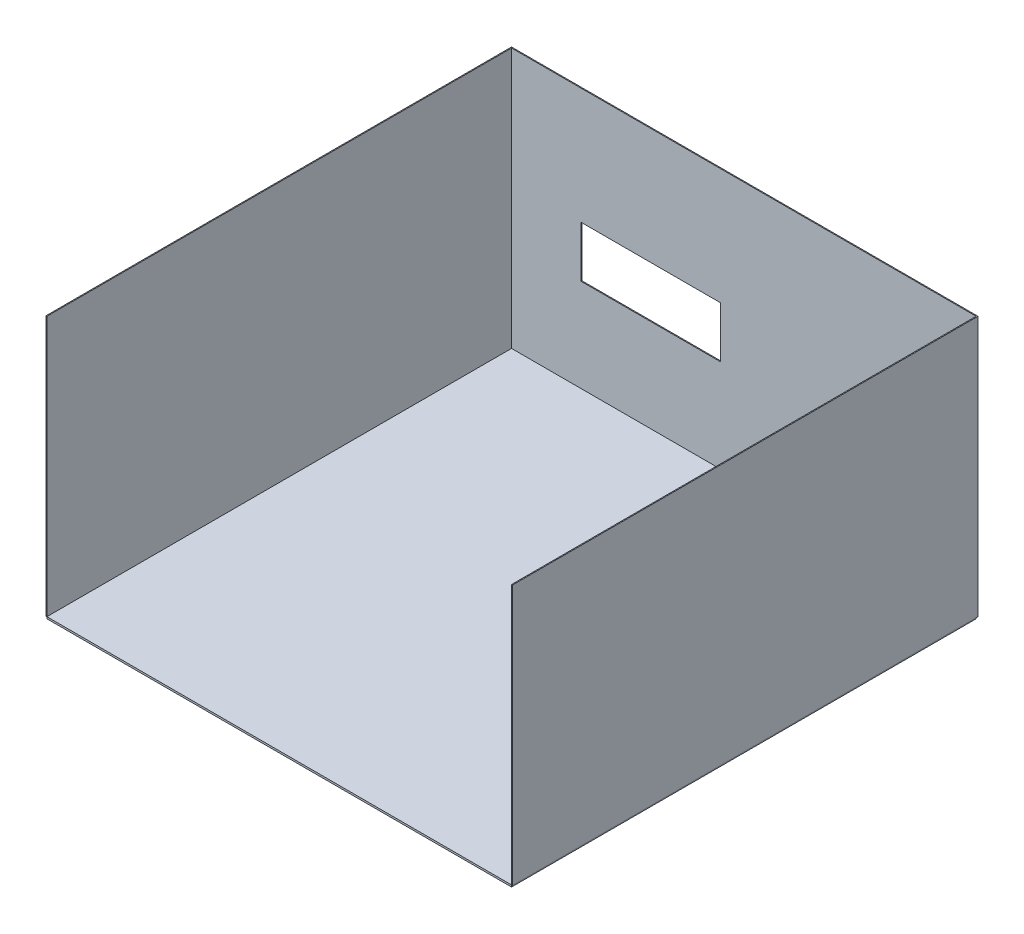
ISO-10303-21;
HEADER;
FILE_DESCRIPTION(('STEP AP214'),'2;1');
FILE_NAME('part.step','',(''),(''),'','','');
FILE_SCHEMA(('AUTOMOTIVE_DESIGN { 1 0 10303 214 1 1 1 1 }'));
ENDSEC;
DATA;
#1=APPLICATION_CONTEXT('core data for automotive mechanical design processes');
#2=APPLICATION_PROTOCOL_DEFINITION('international standard','automotive_design',2000,#1);
#3=PRODUCT_CONTEXT('',#1,'mechanical');
#4=PRODUCT('Part','Part','',(#3));
#5=PRODUCT_RELATED_PRODUCT_CATEGORY('part','',(#4));
#6=PRODUCT_DEFINITION_FORMATION('','',#4);
#7=PRODUCT_DEFINITION_CONTEXT('part definition',#1,'design');
#8=PRODUCT_DEFINITION('design','',#6,#7);
#9=PRODUCT_DEFINITION_SHAPE('','',#8);
#10=(LENGTH_UNIT() NAMED_UNIT(*) SI_UNIT(.MILLI.,.METRE.));
#11=(NAMED_UNIT(*) PLANE_ANGLE_UNIT() SI_UNIT($,.RADIAN.));
#12=(NAMED_UNIT(*) SI_UNIT($,.STERADIAN.) SOLID_ANGLE_UNIT());
#13=UNCERTAINTY_MEASURE_WITH_UNIT(LENGTH_MEASURE(1.E-05),#10,'distance_accuracy_value','');
#14=(GEOMETRIC_REPRESENTATION_CONTEXT(3) GLOBAL_UNCERTAINTY_ASSIGNED_CONTEXT((#13)) GLOBAL_UNIT_ASSIGNED_CONTEXT((#10,
#11,#12)) REPRESENTATION_CONTEXT('',''));
#15=CARTESIAN_POINT('',(0.,0.,0.));
#16=DIRECTION('',(0.,0.,1.));
#17=DIRECTION('',(1.,0.,0.));
#18=AXIS2_PLACEMENT_3D('',#15,#16,#17);
#19=CARTESIAN_POINT('',(-33710.6161425006,2820.,-2909.64545631748));
#20=DIRECTION('',(1.,0.,0.));
#21=DIRECTION('',(0.,0.,-1.));
#22=AXIS2_PLACEMENT_3D('',#19,#20,#21);
#23=PLANE('',#22);
#24=DIRECTION('',(0.,0.,-1.));
#25=VECTOR('',#24,1.);
#26=CARTESIAN_POINT('',(-33710.6161425006,20.,-2909.64545631748));
#27=LINE('',#26,#25);
#28=CARTESIAN_POINT('',(-33710.6161425006,20.,-2919.64545631748));
#29=VERTEX_POINT('',#28);
#30=CARTESIAN_POINT('',(-33710.6161425006,20.,2090.35454368252));
#31=VERTEX_POINT('',#30);
#32=EDGE_CURVE('E168',#29,#31,#27,.F.);
#33=ORIENTED_EDGE('',*,*,#32,.T.);
#34=DIRECTION('',(0.,-1.,0.));
#35=VECTOR('',#34,1.);
#36=CARTESIAN_POINT('',(-33710.6161425006,2820.,2090.35454368252));
#37=LINE('',#36,#35);
#38=CARTESIAN_POINT('',(-33710.6161425006,2820.,2090.35454368252));
#39=VERTEX_POINT('',#38);
#40=EDGE_CURVE('E12',#39,#31,#37,.T.);
#41=ORIENTED_EDGE('',*,*,#40,.F.);
#42=DIRECTION('',(0.,0.,-1.));
#43=VECTOR('',#42,1.);
#44=CARTESIAN_POINT('',(-33710.6161425006,2820.,-2909.64545631748));
#45=LINE('',#44,#43);
#46=CARTESIAN_POINT('',(-33710.6161425006,2820.,-2919.64545631748));
#47=VERTEX_POINT('',#46);
#48=EDGE_CURVE('E172',#47,#39,#45,.F.);
#49=ORIENTED_EDGE('',*,*,#48,.F.);
#50=DIRECTION('',(0.,-1.,0.));
#51=VECTOR('',#50,1.);
#52=CARTESIAN_POINT('',(-33710.6161425006,2820.,-2919.64545631748));
#53=LINE('',#52,#51);
#54=EDGE_CURVE('E194',#47,#29,#53,.T.);
#55=ORIENTED_EDGE('',*,*,#54,.T.);
#56=EDGE_LOOP('',(#33,#41,#49,#55));
#57=FACE_BOUND('',#56,.T.);
#58=ADVANCED_FACE('F48',(#57),#23,.F.);
#59=CARTESIAN_POINT('',(-33700.6161425006,2820.,2090.35454368252));
#60=DIRECTION('',(0.,0.,1.));
#61=DIRECTION('',(1.,0.,0.));
#62=AXIS2_PLACEMENT_3D('',#59,#60,#61);
#63=PLANE('',#62);
#64=DIRECTION('',(-1.,0.,0.));
#65=VECTOR('',#64,1.);
#66=CARTESIAN_POINT('',(-33700.6161425006,20.,2090.35454368252));
#67=LINE('',#66,#65);
#68=CARTESIAN_POINT('',(-33700.6161425006,20.,2090.35454368252));
#69=VERTEX_POINT('',#68);
#70=EDGE_CURVE('E197',#69,#31,#67,.T.);
#71=ORIENTED_EDGE('',*,*,#70,.F.);
#72=DIRECTION('',(0.,-1.,0.));
#73=VECTOR('',#72,1.);
#74=CARTESIAN_POINT('',(-33700.6161425006,2820.,2090.35454368252));
#75=LINE('',#74,#73);
#76=CARTESIAN_POINT('',(-33700.6161425006,2820.,2090.35454368252));
#77=VERTEX_POINT('',#76);
#78=EDGE_CURVE('E55',#77,#69,#75,.T.);
#79=ORIENTED_EDGE('',*,*,#78,.F.);
#80=DIRECTION('',(-1.,0.,0.));
#81=VECTOR('',#80,1.);
#82=CARTESIAN_POINT('',(-33700.6161425006,2820.,2090.35454368252));
#83=LINE('',#82,#81);
#84=EDGE_CURVE('E174',#77,#39,#83,.T.);
#85=ORIENTED_EDGE('',*,*,#84,.T.);
#86=ORIENTED_EDGE('',*,*,#40,.T.);
#87=EDGE_LOOP('',(#71,#79,#85,#86));
#88=FACE_BOUND('',#87,.T.);
#89=ADVANCED_FACE('F234',(#88),#63,.T.);
#90=CARTESIAN_POINT('',(-33700.6161425006,2820.,-2909.64545631748));
#91=DIRECTION('',(1.,0.,0.));
#92=DIRECTION('',(0.,0.,-1.));
#93=AXIS2_PLACEMENT_3D('',#90,#91,#92);
#94=PLANE('',#93);
#95=DIRECTION('',(0.,0.,1.));
#96=VECTOR('',#95,1.);
#97=CARTESIAN_POINT('',(-33700.6161425006,20.,-2909.64545631748));
#98=LINE('',#97,#96);
#99=CARTESIAN_POINT('',(-33700.6161425006,20.,-2909.64545631748));
#100=VERTEX_POINT('',#99);
#101=EDGE_CURVE('E200',#100,#69,#98,.T.);
#102=ORIENTED_EDGE('',*,*,#101,.F.);
#103=DIRECTION('',(0.,-1.,0.));
#104=VECTOR('',#103,1.);
#105=CARTESIAN_POINT('',(-33700.6161425006,2820.,-2909.64545631748));
#106=LINE('',#105,#104);
#107=CARTESIAN_POINT('',(-33700.6161425006,2820.,-2909.64545631748));
#108=VERTEX_POINT('',#107);
#109=EDGE_CURVE('E226',#108,#100,#106,.T.);
#110=ORIENTED_EDGE('',*,*,#109,.F.);
#111=DIRECTION('',(0.,0.,1.));
#112=VECTOR('',#111,1.);
#113=CARTESIAN_POINT('',(-33700.6161425006,2820.,-2909.64545631748));
#114=LINE('',#113,#112);
#115=EDGE_CURVE('E178',#108,#77,#114,.T.);
#116=ORIENTED_EDGE('',*,*,#115,.T.);
#117=ORIENTED_EDGE('',*,*,#78,.T.);
#118=EDGE_LOOP('',(#102,#110,#116,#117));
#119=FACE_BOUND('',#118,.T.);
#120=ADVANCED_FACE('F230',(#119),#94,.T.);
#121=CARTESIAN_POINT('',(-33700.6161425006,2820.,-2909.64545631748));
#122=DIRECTION('',(0.,0.,1.));
#123=DIRECTION('',(1.,0.,0.));
#124=AXIS2_PLACEMENT_3D('',#121,#122,#123);
#125=PLANE('',#124);
#126=DIRECTION('',(0.,-1.,0.));
#127=VECTOR('',#126,1.);
#128=CARTESIAN_POINT('',(-32950.6161425006,1570.,-2909.64545631748));
#129=LINE('',#128,#127);
#130=CARTESIAN_POINT('',(-32950.6161425006,1570.,-2909.64545631748));
#131=VERTEX_POINT('',#130);
#132=CARTESIAN_POINT('',(-32950.6161425006,1020.,-2909.64545631748));
#133=VERTEX_POINT('',#132);
#134=EDGE_CURVE('E62',#131,#133,#129,.T.);
#135=ORIENTED_EDGE('',*,*,#134,.F.);
#136=DIRECTION('',(-1.,0.,0.));
#137=VECTOR('',#136,1.);
#138=CARTESIAN_POINT('',(-32950.6161425006,1570.,-2909.64545631748));
#139=LINE('',#138,#137);
#140=CARTESIAN_POINT('',(-31450.6161425006,1570.,-2909.64545631748));
#141=VERTEX_POINT('',#140);
#142=EDGE_CURVE('E153',#141,#131,#139,.T.);
#143=ORIENTED_EDGE('',*,*,#142,.F.);
#144=DIRECTION('',(0.,1.,0.));
#145=VECTOR('',#144,1.);
#146=CARTESIAN_POINT('',(-31450.6161425006,1570.,-2909.64545631748));
#147=LINE('',#146,#145);
#148=CARTESIAN_POINT('',(-31450.6161425006,1020.,-2909.64545631748));
#149=VERTEX_POINT('',#148);
#150=EDGE_CURVE('E156',#149,#141,#147,.T.);
#151=ORIENTED_EDGE('',*,*,#150,.F.);
#152=DIRECTION('',(1.,0.,0.));
#153=VECTOR('',#152,1.);
#154=CARTESIAN_POINT('',(-32950.6161425006,1020.,-2909.64545631748));
#155=LINE('',#154,#153);
#156=EDGE_CURVE('E162',#133,#149,#155,.T.);
#157=ORIENTED_EDGE('',*,*,#156,.F.);
#158=EDGE_LOOP('',(#135,#143,#151,#157));
#159=FACE_BOUND('',#158,.T.);
#160=DIRECTION('',(-1.,0.,0.));
#161=VECTOR('',#160,1.);
#162=CARTESIAN_POINT('',(-33700.6161425006,20.,-2909.64545631748));
#163=LINE('',#162,#161);
#164=CARTESIAN_POINT('',(-28700.6161425006,20.,-2909.64545631748));
#165=VERTEX_POINT('',#164);
#166=EDGE_CURVE('E203',#165,#100,#163,.T.);
#167=ORIENTED_EDGE('',*,*,#166,.F.);
#168=DIRECTION('',(0.,-1.,0.));
#169=VECTOR('',#168,1.);
#170=CARTESIAN_POINT('',(-28700.6161425006,2820.,-2909.64545631748));
#171=LINE('',#170,#169);
#172=CARTESIAN_POINT('',(-28700.6161425006,2820.,-2909.64545631748));
#173=VERTEX_POINT('',#172);
#174=EDGE_CURVE('E224',#173,#165,#171,.T.);
#175=ORIENTED_EDGE('',*,*,#174,.F.);
#176=DIRECTION('',(-1.,0.,0.));
#177=VECTOR('',#176,1.);
#178=CARTESIAN_POINT('',(-33700.6161425006,2820.,-2909.64545631748));
#179=LINE('',#178,#177);
#180=EDGE_CURVE('E181',#173,#108,#179,.T.);
#181=ORIENTED_EDGE('',*,*,#180,.T.);
#182=ORIENTED_EDGE('',*,*,#109,.T.);
#183=EDGE_LOOP('',(#167,#175,#181,#182));
#184=FACE_BOUND('',#183,.T.);
#185=ADVANCED_FACE('F242',(#159,#184),#125,.T.);
#186=CARTESIAN_POINT('',(-28700.6161425006,2820.,-2909.64545631748));
#187=DIRECTION('',(-1.,0.,0.));
#188=DIRECTION('',(0.,0.,1.));
#189=AXIS2_PLACEMENT_3D('',#186,#187,#188);
#190=PLANE('',#189);
#191=DIRECTION('',(0.,0.,-1.));
#192=VECTOR('',#191,1.);
#193=CARTESIAN_POINT('',(-28700.6161425006,20.,-2909.64545631748));
#194=LINE('',#193,#192);
#195=CARTESIAN_POINT('',(-28700.6161425006,20.,2090.35454368252));
#196=VERTEX_POINT('',#195);
#197=EDGE_CURVE('E206',#196,#165,#194,.T.);
#198=ORIENTED_EDGE('',*,*,#197,.F.);
#199=DIRECTION('',(0.,-1.,0.));
#200=VECTOR('',#199,1.);
#201=CARTESIAN_POINT('',(-28700.6161425006,2820.,2090.35454368252));
#202=LINE('',#201,#200);
#203=CARTESIAN_POINT('',(-28700.6161425006,2820.,2090.35454368252));
#204=VERTEX_POINT('',#203);
#205=EDGE_CURVE('E222',#204,#196,#202,.T.);
#206=ORIENTED_EDGE('',*,*,#205,.F.);
#207=DIRECTION('',(0.,0.,-1.));
#208=VECTOR('',#207,1.);
#209=CARTESIAN_POINT('',(-28700.6161425006,2820.,-2909.64545631748));
#210=LINE('',#209,#208);
#211=EDGE_CURVE('E184',#204,#173,#210,.T.);
#212=ORIENTED_EDGE('',*,*,#211,.T.);
#213=ORIENTED_EDGE('',*,*,#174,.T.);
#214=EDGE_LOOP('',(#198,#206,#212,#213));
#215=FACE_BOUND('',#214,.T.);
#216=ADVANCED_FACE('F262',(#215),#190,.T.);
#217=CARTESIAN_POINT('',(-28690.6161425006,2820.,2090.35454368252));
#218=DIRECTION('',(0.,0.,1.));
#219=DIRECTION('',(1.,0.,0.));
#220=AXIS2_PLACEMENT_3D('',#217,#218,#219);
#221=PLANE('',#220);
#222=DIRECTION('',(-1.,0.,0.));
#223=VECTOR('',#222,1.);
#224=CARTESIAN_POINT('',(-28690.6161425006,20.,2090.35454368252));
#225=LINE('',#224,#223);
#226=CARTESIAN_POINT('',(-28690.6161425006,20.,2090.35454368252));
#227=VERTEX_POINT('',#226);
#228=EDGE_CURVE('E209',#227,#196,#225,.T.);
#229=ORIENTED_EDGE('',*,*,#228,.F.);
#230=DIRECTION('',(0.,-1.,0.));
#231=VECTOR('',#230,1.);
#232=CARTESIAN_POINT('',(-28690.6161425006,2820.,2090.35454368252));
#233=LINE('',#232,#231);
#234=CARTESIAN_POINT('',(-28690.6161425006,2820.,2090.35454368252));
#235=VERTEX_POINT('',#234);
#236=EDGE_CURVE('E220',#235,#227,#233,.T.);
#237=ORIENTED_EDGE('',*,*,#236,.F.);
#238=DIRECTION('',(-1.,0.,0.));
#239=VECTOR('',#238,1.);
#240=CARTESIAN_POINT('',(-28690.6161425006,2820.,2090.35454368252));
#241=LINE('',#240,#239);
#242=EDGE_CURVE('E187',#235,#204,#241,.T.);
#243=ORIENTED_EDGE('',*,*,#242,.T.);
#244=ORIENTED_EDGE('',*,*,#205,.T.);
#245=EDGE_LOOP('',(#229,#237,#243,#244));
#246=FACE_BOUND('',#245,.T.);
#247=ADVANCED_FACE('F260',(#246),#221,.T.);
#248=CARTESIAN_POINT('',(-28690.6161425006,2820.,-2909.64545631748));
#249=DIRECTION('',(-1.,0.,0.));
#250=DIRECTION('',(0.,0.,1.));
#251=AXIS2_PLACEMENT_3D('',#248,#249,#250);
#252=PLANE('',#251);
#253=DIRECTION('',(0.,0.,-1.));
#254=VECTOR('',#253,1.);
#255=CARTESIAN_POINT('',(-28690.6161425006,20.,-2909.64545631748));
#256=LINE('',#255,#254);
#257=CARTESIAN_POINT('',(-28690.6161425006,20.,-2919.64545631748));
#258=VERTEX_POINT('',#257);
#259=EDGE_CURVE('E212',#227,#258,#256,.T.);
#260=ORIENTED_EDGE('',*,*,#259,.T.);
#261=DIRECTION('',(0.,-1.,0.));
#262=VECTOR('',#261,1.);
#263=CARTESIAN_POINT('',(-28690.6161425006,2820.,-2919.64545631748));
#264=LINE('',#263,#262);
#265=CARTESIAN_POINT('',(-28690.6161425006,2820.,-2919.64545631748));
#266=VERTEX_POINT('',#265);
#267=EDGE_CURVE('E217',#266,#258,#264,.T.);
#268=ORIENTED_EDGE('',*,*,#267,.F.);
#269=DIRECTION('',(0.,0.,-1.));
#270=VECTOR('',#269,1.);
#271=CARTESIAN_POINT('',(-28690.6161425006,2820.,-2909.64545631748));
#272=LINE('',#271,#270);
#273=EDGE_CURVE('E190',#235,#266,#272,.T.);
#274=ORIENTED_EDGE('',*,*,#273,.F.);
#275=ORIENTED_EDGE('',*,*,#236,.T.);
#276=EDGE_LOOP('',(#260,#268,#274,#275));
#277=FACE_BOUND('',#276,.T.);
#278=ADVANCED_FACE('F257',(#277),#252,.F.);
#279=CARTESIAN_POINT('',(-33700.6161425006,2820.,-2919.64545631748));
#280=DIRECTION('',(0.,0.,1.));
#281=DIRECTION('',(1.,0.,0.));
#282=AXIS2_PLACEMENT_3D('',#279,#280,#281);
#283=PLANE('',#282);
#284=DIRECTION('',(-1.,0.,0.));
#285=VECTOR('',#284,1.);
#286=CARTESIAN_POINT('',(-32950.6161425006,1570.,-2919.64545631748));
#287=LINE('',#286,#285);
#288=CARTESIAN_POINT('',(-31450.6161425006,1570.,-2919.64545631748));
#289=VERTEX_POINT('',#288);
#290=CARTESIAN_POINT('',(-32950.6161425006,1570.,-2919.64545631748));
#291=VERTEX_POINT('',#290);
#292=EDGE_CURVE('E143',#289,#291,#287,.T.);
#293=ORIENTED_EDGE('',*,*,#292,.T.);
#294=DIRECTION('',(0.,-1.,0.));
#295=VECTOR('',#294,1.);
#296=CARTESIAN_POINT('',(-32950.6161425006,1570.,-2919.64545631748));
#297=LINE('',#296,#295);
#298=CARTESIAN_POINT('',(-32950.6161425006,1020.,-2919.64545631748));
#299=VERTEX_POINT('',#298);
#300=EDGE_CURVE('E137',#291,#299,#297,.T.);
#301=ORIENTED_EDGE('',*,*,#300,.T.);
#302=DIRECTION('',(1.,0.,0.));
#303=VECTOR('',#302,1.);
#304=CARTESIAN_POINT('',(-32950.6161425006,1020.,-2919.64545631748));
#305=LINE('',#304,#303);
#306=CARTESIAN_POINT('',(-31450.6161425006,1020.,-2919.64545631748));
#307=VERTEX_POINT('',#306);
#308=EDGE_CURVE('E146',#299,#307,#305,.T.);
#309=ORIENTED_EDGE('',*,*,#308,.T.);
#310=DIRECTION('',(0.,1.,0.));
#311=VECTOR('',#310,1.);
#312=CARTESIAN_POINT('',(-31450.6161425006,1570.,-2919.64545631748));
#313=LINE('',#312,#311);
#314=EDGE_CURVE('E70',#307,#289,#313,.T.);
#315=ORIENTED_EDGE('',*,*,#314,.T.);
#316=EDGE_LOOP('',(#293,#301,#309,#315));
#317=FACE_BOUND('',#316,.T.);
#318=DIRECTION('',(1.,0.,0.));
#319=VECTOR('',#318,1.);
#320=CARTESIAN_POINT('',(-33700.6161425006,20.,-2919.64545631748));
#321=LINE('',#320,#319);
#322=EDGE_CURVE('E175',#258,#29,#321,.F.);
#323=ORIENTED_EDGE('',*,*,#322,.T.);
#324=ORIENTED_EDGE('',*,*,#54,.F.);
#325=DIRECTION('',(1.,0.,0.));
#326=VECTOR('',#325,1.);
#327=CARTESIAN_POINT('',(-33700.6161425006,2820.,-2919.64545631748));
#328=LINE('',#327,#326);
#329=EDGE_CURVE('E192',#266,#47,#328,.F.);
#330=ORIENTED_EDGE('',*,*,#329,.F.);
#331=ORIENTED_EDGE('',*,*,#267,.T.);
#332=EDGE_LOOP('',(#323,#324,#330,#331));
#333=FACE_BOUND('',#332,.T.);
#334=ADVANCED_FACE('F150',(#317,#333),#283,.F.);
#335=CARTESIAN_POINT('',(0.,2820.,0.));
#336=DIRECTION('',(0.,1.,0.));
#337=DIRECTION('',(1.,0.,0.));
#338=AXIS2_PLACEMENT_3D('',#335,#336,#337);
#339=PLANE('',#338);
#340=ORIENTED_EDGE('',*,*,#48,.T.);
#341=ORIENTED_EDGE('',*,*,#84,.F.);
#342=ORIENTED_EDGE('',*,*,#115,.F.);
#343=ORIENTED_EDGE('',*,*,#180,.F.);
#344=ORIENTED_EDGE('',*,*,#211,.F.);
#345=ORIENTED_EDGE('',*,*,#242,.F.);
#346=ORIENTED_EDGE('',*,*,#273,.T.);
#347=ORIENTED_EDGE('',*,*,#329,.T.);
#348=EDGE_LOOP('',(#340,#341,#342,#343,#344,#345,#346,#347));
#349=FACE_BOUND('',#348,.T.);
#350=ADVANCED_FACE('F245',(#349),#339,.T.);
#351=CARTESIAN_POINT('',(0.,20.,0.));
#352=DIRECTION('',(0.,1.,0.));
#353=DIRECTION('',(1.,0.,0.));
#354=AXIS2_PLACEMENT_3D('',#351,#352,#353);
#355=PLANE('',#354);
#356=ORIENTED_EDGE('',*,*,#32,.F.);
#357=ORIENTED_EDGE('',*,*,#322,.F.);
#358=ORIENTED_EDGE('',*,*,#259,.F.);
#359=ORIENTED_EDGE('',*,*,#228,.T.);
#360=ORIENTED_EDGE('',*,*,#197,.T.);
#361=ORIENTED_EDGE('',*,*,#166,.T.);
#362=ORIENTED_EDGE('',*,*,#101,.T.);
#363=ORIENTED_EDGE('',*,*,#70,.T.);
#364=EDGE_LOOP('',(#356,#357,#358,#359,#360,#361,#362,#363));
#365=FACE_BOUND('',#364,.T.);
#366=ADVANCED_FACE('F238',(#365),#355,.F.);
#367=CARTESIAN_POINT('',(-32950.6161425006,1570.,-2919.64545631748));
#368=DIRECTION('',(-1.,0.,0.));
#369=DIRECTION('',(0.,0.,1.));
#370=AXIS2_PLACEMENT_3D('',#367,#368,#369);
#371=PLANE('',#370);
#372=ORIENTED_EDGE('',*,*,#134,.T.);
#373=DIRECTION('',(0.,0.,1.));
#374=VECTOR('',#373,1.);
#375=CARTESIAN_POINT('',(-32950.6161425006,1020.,-2919.64545631748));
#376=LINE('',#375,#374);
#377=EDGE_CURVE('E133',#299,#133,#376,.T.);
#378=ORIENTED_EDGE('',*,*,#377,.F.);
#379=ORIENTED_EDGE('',*,*,#300,.F.);
#380=DIRECTION('',(0.,0.,1.));
#381=VECTOR('',#380,1.);
#382=CARTESIAN_POINT('',(-32950.6161425006,1570.,-2919.64545631748));
#383=LINE('',#382,#381);
#384=EDGE_CURVE('E166',#291,#131,#383,.T.);
#385=ORIENTED_EDGE('',*,*,#384,.T.);
#386=EDGE_LOOP('',(#372,#378,#379,#385));
#387=FACE_BOUND('',#386,.T.);
#388=ADVANCED_FACE('F135',(#387),#371,.F.);
#389=CARTESIAN_POINT('',(-32950.6161425006,1570.,-2919.64545631748));
#390=DIRECTION('',(0.,1.,0.));
#391=DIRECTION('',(0.,0.,1.));
#392=AXIS2_PLACEMENT_3D('',#389,#390,#391);
#393=PLANE('',#392);
#394=ORIENTED_EDGE('',*,*,#142,.T.);
#395=ORIENTED_EDGE('',*,*,#384,.F.);
#396=ORIENTED_EDGE('',*,*,#292,.F.);
#397=DIRECTION('',(0.,0.,1.));
#398=VECTOR('',#397,1.);
#399=CARTESIAN_POINT('',(-31450.6161425006,1570.,-2919.64545631748));
#400=LINE('',#399,#398);
#401=EDGE_CURVE('E169',#289,#141,#400,.T.);
#402=ORIENTED_EDGE('',*,*,#401,.T.);
#403=EDGE_LOOP('',(#394,#395,#396,#402));
#404=FACE_BOUND('',#403,.T.);
#405=ADVANCED_FACE('F315',(#404),#393,.F.);
#406=CARTESIAN_POINT('',(-31450.6161425006,1570.,-2919.64545631748));
#407=DIRECTION('',(1.,0.,0.));
#408=DIRECTION('',(0.,0.,-1.));
#409=AXIS2_PLACEMENT_3D('',#406,#407,#408);
#410=PLANE('',#409);
#411=ORIENTED_EDGE('',*,*,#150,.T.);
#412=ORIENTED_EDGE('',*,*,#401,.F.);
#413=ORIENTED_EDGE('',*,*,#314,.F.);
#414=DIRECTION('',(0.,0.,1.));
#415=VECTOR('',#414,1.);
#416=CARTESIAN_POINT('',(-31450.6161425006,1020.,-2919.64545631748));
#417=LINE('',#416,#415);
#418=EDGE_CURVE('E142',#307,#149,#417,.T.);
#419=ORIENTED_EDGE('',*,*,#418,.T.);
#420=EDGE_LOOP('',(#411,#412,#413,#419));
#421=FACE_BOUND('',#420,.T.);
#422=ADVANCED_FACE('F325',(#421),#410,.F.);
#423=CARTESIAN_POINT('',(-32950.6161425006,1020.,-2919.64545631748));
#424=DIRECTION('',(0.,-1.,0.));
#425=DIRECTION('',(0.,0.,-1.));
#426=AXIS2_PLACEMENT_3D('',#423,#424,#425);
#427=PLANE('',#426);
#428=ORIENTED_EDGE('',*,*,#156,.T.);
#429=ORIENTED_EDGE('',*,*,#418,.F.);
#430=ORIENTED_EDGE('',*,*,#308,.F.);
#431=ORIENTED_EDGE('',*,*,#377,.T.);
#432=EDGE_LOOP('',(#428,#429,#430,#431));
#433=FACE_BOUND('',#432,.T.);
#434=ADVANCED_FACE('F147',(#433),#427,.F.);
#435=CLOSED_SHELL('',(#58,#89,#120,#185,#216,#247,#278,#334,#350,#366,#388,#405,#422,#434));
#436=MANIFOLD_SOLID_BREP('B2',#435);
#437=CARTESIAN_POINT('',(-33700.6161425006,20.,2090.35454368252));
#438=DIRECTION('',(0.,0.,-1.));
#439=DIRECTION('',(-1.,0.,0.));
#440=AXIS2_PLACEMENT_3D('',#437,#438,#439);
#441=PLANE('',#440);
#442=DIRECTION('',(1.,0.,0.));
#443=VECTOR('',#442,1.);
#444=CARTESIAN_POINT('',(-33700.6161425006,0.,2090.35454368252));
#445=LINE('',#444,#443);
#446=CARTESIAN_POINT('',(-33700.6161425006,0.,2090.35454368252));
#447=VERTEX_POINT('',#446);
#448=CARTESIAN_POINT('',(-28700.6161425006,0.,2090.35454368252));
#449=VERTEX_POINT('',#448);
#450=EDGE_CURVE('E477',#447,#449,#445,.T.);
#451=ORIENTED_EDGE('',*,*,#450,.T.);
#452=DIRECTION('',(0.,-1.,0.));
#453=VECTOR('',#452,1.);
#454=CARTESIAN_POINT('',(-28700.6161425006,20.,2090.35454368252));
#455=LINE('',#454,#453);
#456=CARTESIAN_POINT('',(-28700.6161425006,20.,2090.35454368252));
#457=VERTEX_POINT('',#456);
#458=EDGE_CURVE('E46',#457,#449,#455,.T.);
#459=ORIENTED_EDGE('',*,*,#458,.F.);
#460=DIRECTION('',(1.,0.,0.));
#461=VECTOR('',#460,1.);
#462=CARTESIAN_POINT('',(-33700.6161425006,20.,2090.35454368252));
#463=LINE('',#462,#461);
#464=CARTESIAN_POINT('',(-33700.6161425006,20.,2090.35454368252));
#465=VERTEX_POINT('',#464);
#466=EDGE_CURVE('E454',#465,#457,#463,.T.);
#467=ORIENTED_EDGE('',*,*,#466,.F.);
#468=DIRECTION('',(0.,-1.,0.));
#469=VECTOR('',#468,1.);
#470=CARTESIAN_POINT('',(-33700.6161425006,20.,2090.35454368252));
#471=LINE('',#470,#469);
#472=EDGE_CURVE('E473',#465,#447,#471,.T.);
#473=ORIENTED_EDGE('',*,*,#472,.T.);
#474=EDGE_LOOP('',(#451,#459,#467,#473));
#475=FACE_BOUND('',#474,.T.);
#476=ADVANCED_FACE('F415',(#475),#441,.F.);
#477=CARTESIAN_POINT('',(-28700.6161425006,20.,-2909.64545631748));
#478=DIRECTION('',(1.,0.,0.));
#479=DIRECTION('',(0.,0.,-1.));
#480=AXIS2_PLACEMENT_3D('',#477,#478,#479);
#481=PLANE('',#480);
#482=DIRECTION('',(0.,0.,1.));
#483=VECTOR('',#482,1.);
#484=CARTESIAN_POINT('',(-28700.6161425006,0.,-2909.64545631748));
#485=LINE('',#484,#483);
#486=CARTESIAN_POINT('',(-28700.6161425006,0.,-2909.64545631748));
#487=VERTEX_POINT('',#486);
#488=EDGE_CURVE('E463',#487,#449,#485,.T.);
#489=ORIENTED_EDGE('',*,*,#488,.F.);
#490=DIRECTION('',(0.,-1.,0.));
#491=VECTOR('',#490,1.);
#492=CARTESIAN_POINT('',(-28700.6161425006,20.,-2909.64545631748));
#493=LINE('',#492,#491);
#494=CARTESIAN_POINT('',(-28700.6161425006,20.,-2909.64545631748));
#495=VERTEX_POINT('',#494);
#496=EDGE_CURVE('E423',#495,#487,#493,.T.);
#497=ORIENTED_EDGE('',*,*,#496,.F.);
#498=DIRECTION('',(0.,0.,1.));
#499=VECTOR('',#498,1.);
#500=CARTESIAN_POINT('',(-28700.6161425006,20.,-2909.64545631748));
#501=LINE('',#500,#499);
#502=EDGE_CURVE('E461',#495,#457,#501,.T.);
#503=ORIENTED_EDGE('',*,*,#502,.T.);
#504=ORIENTED_EDGE('',*,*,#458,.T.);
#505=EDGE_LOOP('',(#489,#497,#503,#504));
#506=FACE_BOUND('',#505,.T.);
#507=ADVANCED_FACE('F460',(#506),#481,.T.);
#508=CARTESIAN_POINT('',(-33700.6161425006,20.,-2909.64545631748));
#509=DIRECTION('',(0.,0.,-1.));
#510=DIRECTION('',(-1.,0.,0.));
#511=AXIS2_PLACEMENT_3D('',#508,#509,#510);
#512=PLANE('',#511);
#513=DIRECTION('',(1.,0.,0.));
#514=VECTOR('',#513,1.);
#515=CARTESIAN_POINT('',(-33700.6161425006,0.,-2909.64545631748));
#516=LINE('',#515,#514);
#517=CARTESIAN_POINT('',(-33700.6161425006,0.,-2909.64545631748));
#518=VERTEX_POINT('',#517);
#519=EDGE_CURVE('E481',#518,#487,#516,.T.);
#520=ORIENTED_EDGE('',*,*,#519,.F.);
#521=DIRECTION('',(0.,-1.,0.));
#522=VECTOR('',#521,1.);
#523=CARTESIAN_POINT('',(-33700.6161425006,20.,-2909.64545631748));
#524=LINE('',#523,#522);
#525=CARTESIAN_POINT('',(-33700.6161425006,20.,-2909.64545631748));
#526=VERTEX_POINT('',#525);
#527=EDGE_CURVE('E446',#526,#518,#524,.T.);
#528=ORIENTED_EDGE('',*,*,#527,.F.);
#529=DIRECTION('',(1.,0.,0.));
#530=VECTOR('',#529,1.);
#531=CARTESIAN_POINT('',(-33700.6161425006,20.,-2909.64545631748));
#532=LINE('',#531,#530);
#533=EDGE_CURVE('E469',#526,#495,#532,.T.);
#534=ORIENTED_EDGE('',*,*,#533,.T.);
#535=ORIENTED_EDGE('',*,*,#496,.T.);
#536=EDGE_LOOP('',(#520,#528,#534,#535));
#537=FACE_BOUND('',#536,.T.);
#538=ADVANCED_FACE('F471',(#537),#512,.T.);
#539=CARTESIAN_POINT('',(-33700.6161425006,20.,-2909.64545631748));
#540=DIRECTION('',(1.,0.,0.));
#541=DIRECTION('',(0.,0.,-1.));
#542=AXIS2_PLACEMENT_3D('',#539,#540,#541);
#543=PLANE('',#542);
#544=DIRECTION('',(0.,0.,1.));
#545=VECTOR('',#544,1.);
#546=CARTESIAN_POINT('',(-33700.6161425006,0.,-2909.64545631748));
#547=LINE('',#546,#545);
#548=EDGE_CURVE('E449',#518,#447,#547,.T.);
#549=ORIENTED_EDGE('',*,*,#548,.T.);
#550=ORIENTED_EDGE('',*,*,#472,.F.);
#551=DIRECTION('',(0.,0.,1.));
#552=VECTOR('',#551,1.);
#553=CARTESIAN_POINT('',(-33700.6161425006,20.,-2909.64545631748));
#554=LINE('',#553,#552);
#555=EDGE_CURVE('E431',#526,#465,#554,.T.);
#556=ORIENTED_EDGE('',*,*,#555,.F.);
#557=ORIENTED_EDGE('',*,*,#527,.T.);
#558=EDGE_LOOP('',(#549,#550,#556,#557));
#559=FACE_BOUND('',#558,.T.);
#560=ADVANCED_FACE('F494',(#559),#543,.F.);
#561=CARTESIAN_POINT('',(0.,20.,0.));
#562=DIRECTION('',(0.,-1.,0.));
#563=DIRECTION('',(0.,0.,-1.));
#564=AXIS2_PLACEMENT_3D('',#561,#562,#563);
#565=PLANE('',#564);
#566=ORIENTED_EDGE('',*,*,#466,.T.);
#567=ORIENTED_EDGE('',*,*,#502,.F.);
#568=ORIENTED_EDGE('',*,*,#533,.F.);
#569=ORIENTED_EDGE('',*,*,#555,.T.);
#570=EDGE_LOOP('',(#566,#567,#568,#569));
#571=FACE_BOUND('',#570,.T.);
#572=ADVANCED_FACE('F468',(#571),#565,.F.);
#573=CARTESIAN_POINT('',(0.,0.,0.));
#574=DIRECTION('',(0.,-1.,0.));
#575=DIRECTION('',(0.,0.,-1.));
#576=AXIS2_PLACEMENT_3D('',#573,#574,#575);
#577=PLANE('',#576);
#578=ORIENTED_EDGE('',*,*,#450,.F.);
#579=ORIENTED_EDGE('',*,*,#548,.F.);
#580=ORIENTED_EDGE('',*,*,#519,.T.);
#581=ORIENTED_EDGE('',*,*,#488,.T.);
#582=EDGE_LOOP('',(#578,#579,#580,#581));
#583=FACE_BOUND('',#582,.T.);
#584=ADVANCED_FACE('F488',(#583),#577,.T.);
#585=CLOSED_SHELL('',(#476,#507,#538,#560,#572,#584));
#586=MANIFOLD_SOLID_BREP('B6',#585);
#587=ADVANCED_BREP_SHAPE_REPRESENTATION('',(#18,#436,#586),#14);
#588=SHAPE_DEFINITION_REPRESENTATION(#9,#587);
ENDSEC;
END-ISO-10303-21;
